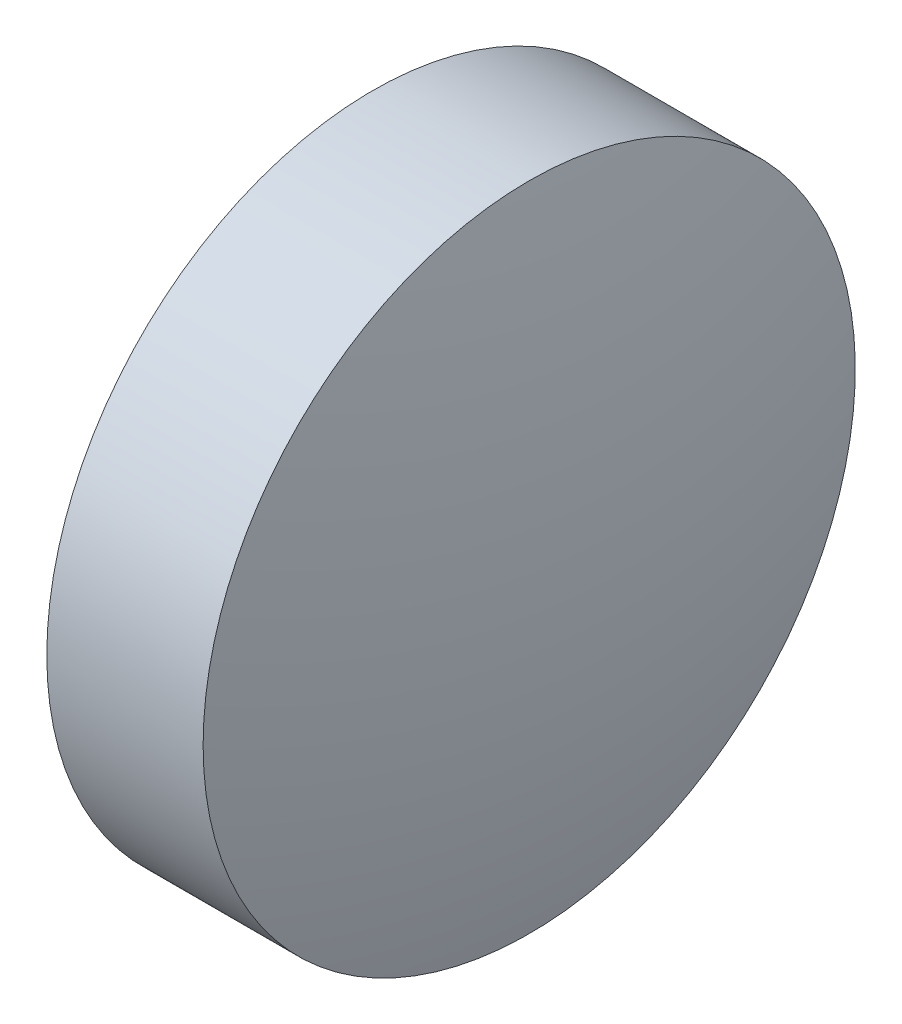
ISO-10303-21;
HEADER;
FILE_DESCRIPTION(('STEP AP214'),'2;1');
FILE_NAME('part.step','',(''),(''),'','','');
FILE_SCHEMA(('AUTOMOTIVE_DESIGN { 1 0 10303 214 1 1 1 1 }'));
ENDSEC;
DATA;
#1=APPLICATION_CONTEXT('core data for automotive mechanical design processes');
#2=APPLICATION_PROTOCOL_DEFINITION('international standard','automotive_design',2000,#1);
#3=PRODUCT_CONTEXT('',#1,'mechanical');
#4=PRODUCT('Part','Part','',(#3));
#5=PRODUCT_RELATED_PRODUCT_CATEGORY('part','',(#4));
#6=PRODUCT_DEFINITION_FORMATION('','',#4);
#7=PRODUCT_DEFINITION_CONTEXT('part definition',#1,'design');
#8=PRODUCT_DEFINITION('design','',#6,#7);
#9=PRODUCT_DEFINITION_SHAPE('','',#8);
#10=(LENGTH_UNIT() NAMED_UNIT(*) SI_UNIT(.MILLI.,.METRE.));
#11=(NAMED_UNIT(*) PLANE_ANGLE_UNIT() SI_UNIT($,.RADIAN.));
#12=(NAMED_UNIT(*) SI_UNIT($,.STERADIAN.) SOLID_ANGLE_UNIT());
#13=UNCERTAINTY_MEASURE_WITH_UNIT(LENGTH_MEASURE(1.E-05),#10,'distance_accuracy_value','');
#14=(GEOMETRIC_REPRESENTATION_CONTEXT(3) GLOBAL_UNCERTAINTY_ASSIGNED_CONTEXT((#13)) GLOBAL_UNIT_ASSIGNED_CONTEXT((#10,
#11,#12)) REPRESENTATION_CONTEXT('',''));
#15=CARTESIAN_POINT('',(0.,0.,0.));
#16=DIRECTION('',(0.,0.,1.));
#17=DIRECTION('',(1.,0.,0.));
#18=AXIS2_PLACEMENT_3D('',#15,#16,#17);
#19=CARTESIAN_POINT('',(436.868382931417,67.5873519065829,0.));
#20=DIRECTION('',(-1.,0.,0.));
#21=DIRECTION('',(0.,1.,0.));
#22=AXIS2_PLACEMENT_3D('',#19,#20,#21);
#23=SPHERICAL_SURFACE('',#22,12.9161538461538);
#24=CARTESIAN_POINT('',(449.394536777571,67.587351906583,0.));
#25=DIRECTION('',(-1.,0.,0.));
#26=DIRECTION('',(0.,0.,1.));
#27=AXIS2_PLACEMENT_3D('',#24,#25,#26);
#28=CIRCLE('',#27,3.15000000000001);
#29=CARTESIAN_POINT('',(449.394536777571,67.587351906583,3.15000000000001));
#30=VERTEX_POINT('',#29);
#31=EDGE_CURVE('E10',#30,#30,#28,.T.);
#32=ORIENTED_EDGE('',*,*,#31,.F.);
#33=EDGE_LOOP('',(#32));
#34=FACE_BOUND('',#33,.T.);
#35=ADVANCED_FACE('F35',(#34),#23,.T.);
#36=CARTESIAN_POINT('',(447.022908607986,67.587351906583,0.));
#37=DIRECTION('',(-1.,0.,0.));
#38=DIRECTION('',(0.,0.,1.));
#39=AXIS2_PLACEMENT_3D('',#36,#37,#38);
#40=CYLINDRICAL_SURFACE('',#39,3.15000000000001);
#41=CARTESIAN_POINT('',(447.884536777571,67.587351906583,0.));
#42=DIRECTION('',(-1.,0.,0.));
#43=DIRECTION('',(0.,0.,1.));
#44=AXIS2_PLACEMENT_3D('',#41,#42,#43);
#45=CIRCLE('',#44,3.15000000000001);
#46=CARTESIAN_POINT('',(447.884536777571,67.587351906583,3.15000000000001));
#47=VERTEX_POINT('',#46);
#48=EDGE_CURVE('E41',#47,#47,#45,.T.);
#49=ORIENTED_EDGE('',*,*,#48,.F.);
#50=EDGE_LOOP('',(#49));
#51=FACE_BOUND('',#50,.T.);
#52=ORIENTED_EDGE('',*,*,#31,.T.);
#53=EDGE_LOOP('',(#52));
#54=FACE_BOUND('',#53,.T.);
#55=ADVANCED_FACE('F49',(#51,#54),#40,.T.);
#56=CARTESIAN_POINT('',(447.884536777571,67.587351906583,0.));
#57=DIRECTION('',(1.,0.,0.));
#58=DIRECTION('',(0.,0.,-1.));
#59=AXIS2_PLACEMENT_3D('',#56,#57,#58);
#60=PLANE('',#59);
#61=ORIENTED_EDGE('',*,*,#48,.T.);
#62=EDGE_LOOP('',(#61));
#63=FACE_BOUND('',#62,.T.);
#64=ADVANCED_FACE('F47',(#63),#60,.F.);
#65=CLOSED_SHELL('',(#35,#55,#64));
#66=MANIFOLD_SOLID_BREP('B2',#65);
#67=ADVANCED_BREP_SHAPE_REPRESENTATION('',(#18,#66),#14);
#68=SHAPE_DEFINITION_REPRESENTATION(#9,#67);
ENDSEC;
END-ISO-10303-21;
